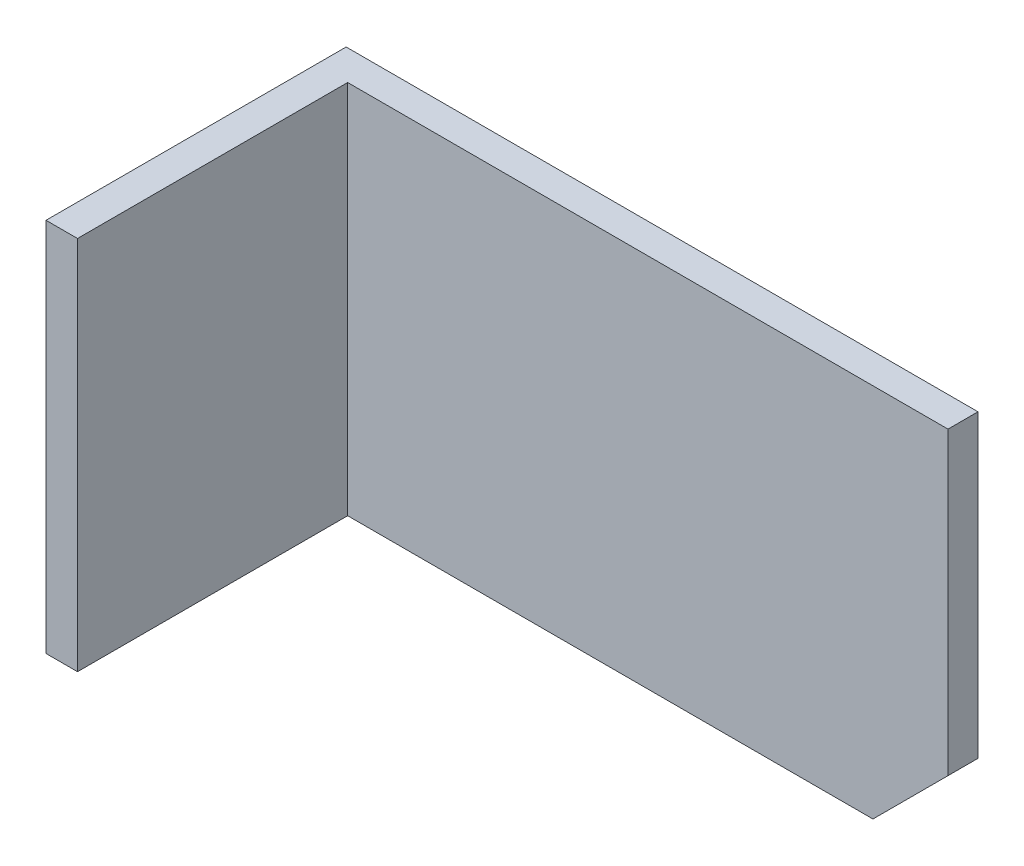
ISO-10303-21;
HEADER;
FILE_DESCRIPTION(('STEP AP214'),'2;1');
FILE_NAME('part.step','',(''),(''),'','','');
FILE_SCHEMA(('AUTOMOTIVE_DESIGN { 1 0 10303 214 1 1 1 1 }'));
ENDSEC;
DATA;
#1=APPLICATION_CONTEXT('core data for automotive mechanical design processes');
#2=APPLICATION_PROTOCOL_DEFINITION('international standard','automotive_design',2000,#1);
#3=PRODUCT_CONTEXT('',#1,'mechanical');
#4=PRODUCT('Part','Part','',(#3));
#5=PRODUCT_RELATED_PRODUCT_CATEGORY('part','',(#4));
#6=PRODUCT_DEFINITION_FORMATION('','',#4);
#7=PRODUCT_DEFINITION_CONTEXT('part definition',#1,'design');
#8=PRODUCT_DEFINITION('design','',#6,#7);
#9=PRODUCT_DEFINITION_SHAPE('','',#8);
#10=(LENGTH_UNIT() NAMED_UNIT(*) SI_UNIT(.MILLI.,.METRE.));
#11=(NAMED_UNIT(*) PLANE_ANGLE_UNIT() SI_UNIT($,.RADIAN.));
#12=(NAMED_UNIT(*) SI_UNIT($,.STERADIAN.) SOLID_ANGLE_UNIT());
#13=UNCERTAINTY_MEASURE_WITH_UNIT(LENGTH_MEASURE(1.E-05),#10,'distance_accuracy_value','');
#14=(GEOMETRIC_REPRESENTATION_CONTEXT(3) GLOBAL_UNCERTAINTY_ASSIGNED_CONTEXT((#13)) GLOBAL_UNIT_ASSIGNED_CONTEXT((#10,
#11,#12)) REPRESENTATION_CONTEXT('',''));
#15=CARTESIAN_POINT('',(0.,0.,0.));
#16=DIRECTION('',(0.,0.,1.));
#17=DIRECTION('',(1.,0.,0.));
#18=AXIS2_PLACEMENT_3D('',#15,#16,#17);
#19=CARTESIAN_POINT('',(-1.53882069959544,-0.75,0.2));
#20=DIRECTION('',(0.,0.,1.));
#21=DIRECTION('',(1.,0.,0.));
#22=AXIS2_PLACEMENT_3D('',#19,#20,#21);
#23=PLANE('',#22);
#24=DIRECTION('',(0.,-1.,0.));
#25=VECTOR('',#24,1.);
#26=CARTESIAN_POINT('',(-1.54932069959544,-0.75,0.2));
#27=LINE('',#26,#25);
#28=CARTESIAN_POINT('',(-1.54932069959544,-0.625,0.2));
#29=VERTEX_POINT('',#28);
#30=CARTESIAN_POINT('',(-1.54932069959544,-0.875,0.2));
#31=VERTEX_POINT('',#30);
#32=EDGE_CURVE('E87',#29,#31,#27,.T.);
#33=ORIENTED_EDGE('',*,*,#32,.T.);
#34=DIRECTION('',(1.,0.,0.));
#35=VECTOR('',#34,1.);
#36=CARTESIAN_POINT('',(-1.41898707437652,-0.875,0.2));
#37=LINE('',#36,#35);
#38=CARTESIAN_POINT('',(-1.52832069959544,-0.875,0.2));
#39=VERTEX_POINT('',#38);
#40=EDGE_CURVE('E90',#31,#39,#37,.T.);
#41=ORIENTED_EDGE('',*,*,#40,.T.);
#42=DIRECTION('',(0.,-1.,0.));
#43=VECTOR('',#42,1.);
#44=CARTESIAN_POINT('',(-1.52832069959544,-0.75,0.2));
#45=LINE('',#44,#43);
#46=CARTESIAN_POINT('',(-1.52832069959544,-0.625,0.2));
#47=VERTEX_POINT('',#46);
#48=EDGE_CURVE('E11',#47,#39,#45,.T.);
#49=ORIENTED_EDGE('',*,*,#48,.F.);
#50=DIRECTION('',(1.,0.,0.));
#51=VECTOR('',#50,1.);
#52=CARTESIAN_POINT('',(-1.39679171408819,-0.625,0.2));
#53=LINE('',#52,#51);
#54=EDGE_CURVE('E93',#29,#47,#53,.T.);
#55=ORIENTED_EDGE('',*,*,#54,.F.);
#56=EDGE_LOOP('',(#33,#41,#49,#55));
#57=FACE_BOUND('',#56,.T.);
#58=ADVANCED_FACE('F17',(#57),#23,.T.);
#59=CARTESIAN_POINT('',(-1.52832069959544,-0.75,0.11));
#60=DIRECTION('',(1.,0.,0.));
#61=DIRECTION('',(0.,1.,0.));
#62=AXIS2_PLACEMENT_3D('',#59,#60,#61);
#63=PLANE('',#62);
#64=DIRECTION('',(0.,0.,-1.));
#65=VECTOR('',#64,1.);
#66=CARTESIAN_POINT('',(-1.52832069959544,-0.625,0.0420289855072459));
#67=LINE('',#66,#65);
#68=CARTESIAN_POINT('',(-1.52832069959544,-0.625,0.02));
#69=VERTEX_POINT('',#68);
#70=EDGE_CURVE('E143',#47,#69,#67,.T.);
#71=ORIENTED_EDGE('',*,*,#70,.F.);
#72=ORIENTED_EDGE('',*,*,#48,.T.);
#73=DIRECTION('',(0.,0.,-1.));
#74=VECTOR('',#73,1.);
#75=CARTESIAN_POINT('',(-1.52832069959544,-0.875,0.0448336252189136));
#76=LINE('',#75,#74);
#77=CARTESIAN_POINT('',(-1.52832069959544,-0.875,0.02));
#78=VERTEX_POINT('',#77);
#79=EDGE_CURVE('E113',#39,#78,#76,.T.);
#80=ORIENTED_EDGE('',*,*,#79,.T.);
#81=DIRECTION('',(0.,-1.,0.));
#82=VECTOR('',#81,1.);
#83=CARTESIAN_POINT('',(-1.52832069959544,-0.746711342510853,0.02));
#84=LINE('',#83,#82);
#85=EDGE_CURVE('E25',#69,#78,#84,.T.);
#86=ORIENTED_EDGE('',*,*,#85,.F.);
#87=EDGE_LOOP('',(#71,#72,#80,#86));
#88=FACE_BOUND('',#87,.T.);
#89=ADVANCED_FACE('F163',(#88),#63,.T.);
#90=CARTESIAN_POINT('',(-1.33333807407652,-0.746711342510853,0.02));
#91=DIRECTION('',(0.,0.,1.));
#92=DIRECTION('',(1.,0.,0.));
#93=AXIS2_PLACEMENT_3D('',#90,#91,#92);
#94=PLANE('',#93);
#95=DIRECTION('',(0.,-1.,0.));
#96=VECTOR('',#95,1.);
#97=CARTESIAN_POINT('',(-1.12832069959544,-0.725,0.02));
#98=LINE('',#97,#96);
#99=CARTESIAN_POINT('',(-1.12832069959544,-0.625,0.02));
#100=VERTEX_POINT('',#99);
#101=CARTESIAN_POINT('',(-1.12832069959544,-0.825,0.02));
#102=VERTEX_POINT('',#101);
#103=EDGE_CURVE('E38',#100,#102,#98,.T.);
#104=ORIENTED_EDGE('',*,*,#103,.F.);
#105=DIRECTION('',(1.,0.,0.));
#106=VECTOR('',#105,1.);
#107=CARTESIAN_POINT('',(-1.39679171408819,-0.625,0.02));
#108=LINE('',#107,#106);
#109=EDGE_CURVE('E149',#69,#100,#108,.T.);
#110=ORIENTED_EDGE('',*,*,#109,.F.);
#111=ORIENTED_EDGE('',*,*,#85,.T.);
#112=DIRECTION('',(1.,0.,0.));
#113=VECTOR('',#112,1.);
#114=CARTESIAN_POINT('',(-1.41898707437652,-0.875,0.02));
#115=LINE('',#114,#113);
#116=CARTESIAN_POINT('',(-1.17832069959544,-0.875,0.02));
#117=VERTEX_POINT('',#116);
#118=EDGE_CURVE('E120',#78,#117,#115,.T.);
#119=ORIENTED_EDGE('',*,*,#118,.T.);
#120=DIRECTION('',(0.707106781186549,0.707106781186546,0.));
#121=VECTOR('',#120,1.);
#122=CARTESIAN_POINT('',(-1.15332069959544,-0.85,0.02));
#123=LINE('',#122,#121);
#124=EDGE_CURVE('E138',#117,#102,#123,.T.);
#125=ORIENTED_EDGE('',*,*,#124,.T.);
#126=EDGE_LOOP('',(#104,#110,#111,#119,#125));
#127=FACE_BOUND('',#126,.T.);
#128=ADVANCED_FACE('F161',(#127),#94,.T.);
#129=CARTESIAN_POINT('',(-1.12832069959544,-0.725,0.01));
#130=DIRECTION('',(1.,0.,0.));
#131=DIRECTION('',(0.,0.,-1.));
#132=AXIS2_PLACEMENT_3D('',#129,#130,#131);
#133=PLANE('',#132);
#134=DIRECTION('',(0.,0.,-1.));
#135=VECTOR('',#134,1.);
#136=CARTESIAN_POINT('',(-1.12832069959544,-0.825,0.01));
#137=LINE('',#136,#135);
#138=CARTESIAN_POINT('',(-1.12832069959544,-0.825,0.));
#139=VERTEX_POINT('',#138);
#140=EDGE_CURVE('E134',#102,#139,#137,.T.);
#141=ORIENTED_EDGE('',*,*,#140,.T.);
#142=DIRECTION('',(0.,1.,0.));
#143=VECTOR('',#142,1.);
#144=CARTESIAN_POINT('',(-1.12832069959544,-0.746816562660918,0.));
#145=LINE('',#144,#143);
#146=CARTESIAN_POINT('',(-1.12832069959544,-0.625,0.));
#147=VERTEX_POINT('',#146);
#148=EDGE_CURVE('E126',#139,#147,#145,.T.);
#149=ORIENTED_EDGE('',*,*,#148,.T.);
#150=DIRECTION('',(0.,0.,-1.));
#151=VECTOR('',#150,1.);
#152=CARTESIAN_POINT('',(-1.12832069959544,-0.625,0.0420289855072459));
#153=LINE('',#152,#151);
#154=EDGE_CURVE('E153',#100,#147,#153,.T.);
#155=ORIENTED_EDGE('',*,*,#154,.F.);
#156=ORIENTED_EDGE('',*,*,#103,.T.);
#157=EDGE_LOOP('',(#141,#149,#155,#156));
#158=FACE_BOUND('',#157,.T.);
#159=ADVANCED_FACE('F299',(#158),#133,.T.);
#160=CARTESIAN_POINT('',(-1.39679171408819,-0.625,0.0420289855072459));
#161=DIRECTION('',(0.,1.,0.));
#162=DIRECTION('',(0.,0.,-1.));
#163=AXIS2_PLACEMENT_3D('',#160,#161,#162);
#164=PLANE('',#163);
#165=DIRECTION('',(0.,0.,1.));
#166=VECTOR('',#165,1.);
#167=CARTESIAN_POINT('',(-1.54932069959544,-0.625,0.0999999999999988));
#168=LINE('',#167,#166);
#169=CARTESIAN_POINT('',(-1.54932069959544,-0.625,0.));
#170=VERTEX_POINT('',#169);
#171=EDGE_CURVE('E97',#170,#29,#168,.T.);
#172=ORIENTED_EDGE('',*,*,#171,.T.);
#173=ORIENTED_EDGE('',*,*,#54,.T.);
#174=ORIENTED_EDGE('',*,*,#70,.T.);
#175=ORIENTED_EDGE('',*,*,#109,.T.);
#176=ORIENTED_EDGE('',*,*,#154,.T.);
#177=DIRECTION('',(-1.,0.,0.));
#178=VECTOR('',#177,1.);
#179=CARTESIAN_POINT('',(-1.34391182083059,-0.625,0.));
#180=LINE('',#179,#178);
#181=EDGE_CURVE('E123',#147,#170,#180,.T.);
#182=ORIENTED_EDGE('',*,*,#181,.T.);
#183=EDGE_LOOP('',(#172,#173,#174,#175,#176,#182));
#184=FACE_BOUND('',#183,.T.);
#185=ADVANCED_FACE('F190',(#184),#164,.T.);
#186=CARTESIAN_POINT('',(-1.54932069959544,-0.75,0.0999999999999988));
#187=DIRECTION('',(1.,0.,0.));
#188=DIRECTION('',(0.,1.,0.));
#189=AXIS2_PLACEMENT_3D('',#186,#187,#188);
#190=PLANE('',#189);
#191=DIRECTION('',(0.,-1.,0.));
#192=VECTOR('',#191,1.);
#193=CARTESIAN_POINT('',(-1.54932069959544,-0.746816562660918,0.));
#194=LINE('',#193,#192);
#195=CARTESIAN_POINT('',(-1.54932069959544,-0.875,0.));
#196=VERTEX_POINT('',#195);
#197=EDGE_CURVE('E105',#170,#196,#194,.T.);
#198=ORIENTED_EDGE('',*,*,#197,.T.);
#199=DIRECTION('',(0.,0.,1.));
#200=VECTOR('',#199,1.);
#201=CARTESIAN_POINT('',(-1.54932069959544,-0.875,0.0448336252189136));
#202=LINE('',#201,#200);
#203=EDGE_CURVE('E98',#196,#31,#202,.T.);
#204=ORIENTED_EDGE('',*,*,#203,.T.);
#205=ORIENTED_EDGE('',*,*,#32,.F.);
#206=ORIENTED_EDGE('',*,*,#171,.F.);
#207=EDGE_LOOP('',(#198,#204,#205,#206));
#208=FACE_BOUND('',#207,.T.);
#209=ADVANCED_FACE('F102',(#208),#190,.F.);
#210=CARTESIAN_POINT('',(-1.41898707437652,-0.875,0.0448336252189136));
#211=DIRECTION('',(0.,1.,0.));
#212=DIRECTION('',(0.,0.,-1.));
#213=AXIS2_PLACEMENT_3D('',#210,#211,#212);
#214=PLANE('',#213);
#215=ORIENTED_EDGE('',*,*,#118,.F.);
#216=ORIENTED_EDGE('',*,*,#79,.F.);
#217=ORIENTED_EDGE('',*,*,#40,.F.);
#218=ORIENTED_EDGE('',*,*,#203,.F.);
#219=DIRECTION('',(1.,0.,0.));
#220=VECTOR('',#219,1.);
#221=CARTESIAN_POINT('',(-1.34391182083059,-0.875,0.));
#222=LINE('',#221,#220);
#223=CARTESIAN_POINT('',(-1.17832069959544,-0.875,0.));
#224=VERTEX_POINT('',#223);
#225=EDGE_CURVE('E166',#196,#224,#222,.T.);
#226=ORIENTED_EDGE('',*,*,#225,.T.);
#227=DIRECTION('',(0.,0.,1.));
#228=VECTOR('',#227,1.);
#229=CARTESIAN_POINT('',(-1.17832069959544,-0.875,0.01));
#230=LINE('',#229,#228);
#231=EDGE_CURVE('E137',#224,#117,#230,.T.);
#232=ORIENTED_EDGE('',*,*,#231,.T.);
#233=EDGE_LOOP('',(#215,#216,#217,#218,#226,#232));
#234=FACE_BOUND('',#233,.T.);
#235=ADVANCED_FACE('F112',(#234),#214,.F.);
#236=CARTESIAN_POINT('',(-1.15332069959544,-0.85,0.01));
#237=DIRECTION('',(-0.707106781186546,0.707106781186549,0.));
#238=DIRECTION('',(0.,0.,1.));
#239=AXIS2_PLACEMENT_3D('',#236,#237,#238);
#240=PLANE('',#239);
#241=ORIENTED_EDGE('',*,*,#140,.F.);
#242=ORIENTED_EDGE('',*,*,#124,.F.);
#243=ORIENTED_EDGE('',*,*,#231,.F.);
#244=DIRECTION('',(0.707106781186534,0.707106781186561,0.));
#245=VECTOR('',#244,1.);
#246=CARTESIAN_POINT('',(-1.17832069959543,-0.875,0.));
#247=LINE('',#246,#245);
#248=EDGE_CURVE('E130',#224,#139,#247,.T.);
#249=ORIENTED_EDGE('',*,*,#248,.T.);
#250=EDGE_LOOP('',(#241,#242,#243,#249));
#251=FACE_BOUND('',#250,.T.);
#252=ADVANCED_FACE('F170',(#251),#240,.F.);
#253=CARTESIAN_POINT('',(-1.34391182083059,-0.746816562660918,0.));
#254=DIRECTION('',(0.,0.,1.));
#255=DIRECTION('',(1.,0.,0.));
#256=AXIS2_PLACEMENT_3D('',#253,#254,#255);
#257=PLANE('',#256);
#258=ORIENTED_EDGE('',*,*,#225,.F.);
#259=ORIENTED_EDGE('',*,*,#197,.F.);
#260=ORIENTED_EDGE('',*,*,#181,.F.);
#261=ORIENTED_EDGE('',*,*,#148,.F.);
#262=ORIENTED_EDGE('',*,*,#248,.F.);
#263=EDGE_LOOP('',(#258,#259,#260,#261,#262));
#264=FACE_BOUND('',#263,.T.);
#265=ADVANCED_FACE('F192',(#264),#257,.F.);
#266=CLOSED_SHELL('',(#58,#89,#128,#159,#185,#209,#235,#252,#265));
#267=MANIFOLD_SOLID_BREP('B1',#266);
#268=ADVANCED_BREP_SHAPE_REPRESENTATION('',(#18,#267),#14);
#269=SHAPE_DEFINITION_REPRESENTATION(#9,#268);
ENDSEC;
END-ISO-10303-21;
